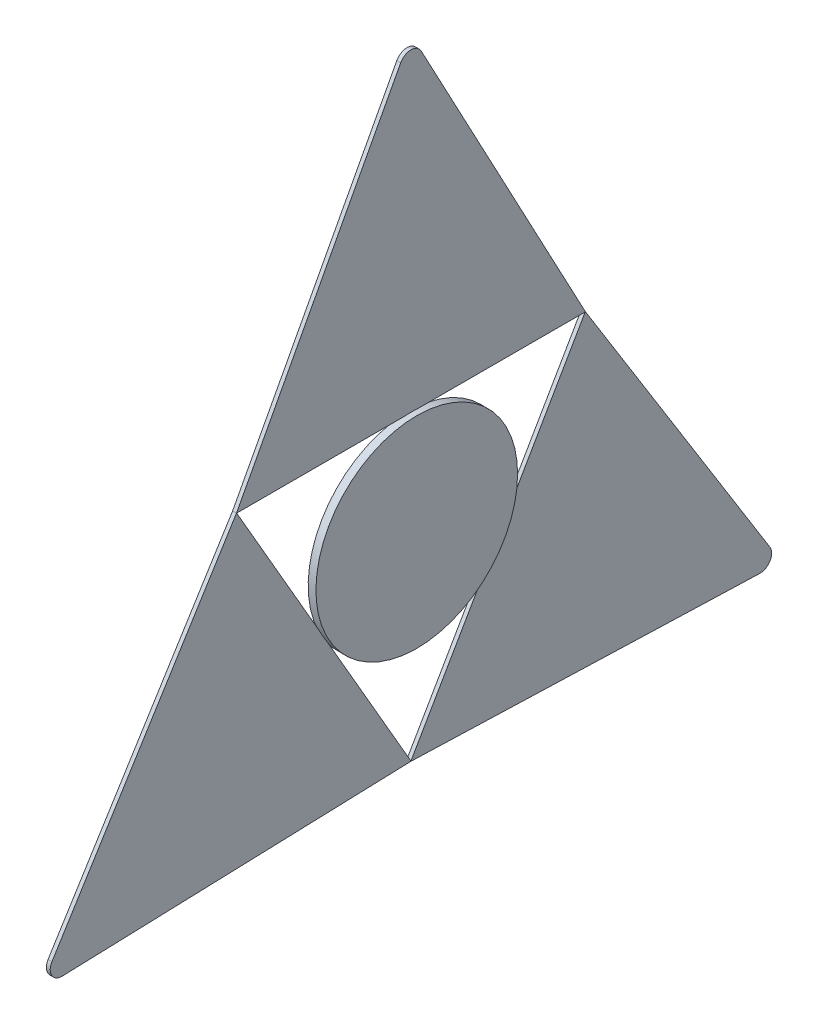
ISO-10303-21;
HEADER;
FILE_DESCRIPTION(('STEP AP214'),'2;1');
FILE_NAME('part.step','',(''),(''),'','','');
FILE_SCHEMA(('AUTOMOTIVE_DESIGN { 1 0 10303 214 1 1 1 1 }'));
ENDSEC;
DATA;
#1=APPLICATION_CONTEXT('core data for automotive mechanical design processes');
#2=APPLICATION_PROTOCOL_DEFINITION('international standard','automotive_design',2000,#1);
#3=PRODUCT_CONTEXT('',#1,'mechanical');
#4=PRODUCT('Part','Part','',(#3));
#5=PRODUCT_RELATED_PRODUCT_CATEGORY('part','',(#4));
#6=PRODUCT_DEFINITION_FORMATION('','',#4);
#7=PRODUCT_DEFINITION_CONTEXT('part definition',#1,'design');
#8=PRODUCT_DEFINITION('design','',#6,#7);
#9=PRODUCT_DEFINITION_SHAPE('','',#8);
#10=(LENGTH_UNIT() NAMED_UNIT(*) SI_UNIT(.MILLI.,.METRE.));
#11=(NAMED_UNIT(*) PLANE_ANGLE_UNIT() SI_UNIT($,.RADIAN.));
#12=(NAMED_UNIT(*) SI_UNIT($,.STERADIAN.) SOLID_ANGLE_UNIT());
#13=UNCERTAINTY_MEASURE_WITH_UNIT(LENGTH_MEASURE(1.E-05),#10,'distance_accuracy_value','');
#14=(GEOMETRIC_REPRESENTATION_CONTEXT(3) GLOBAL_UNCERTAINTY_ASSIGNED_CONTEXT((#13)) GLOBAL_UNIT_ASSIGNED_CONTEXT((#10,
#11,#12)) REPRESENTATION_CONTEXT('',''));
#15=CARTESIAN_POINT('',(0.,0.,0.));
#16=DIRECTION('',(0.,0.,1.));
#17=DIRECTION('',(1.,0.,0.));
#18=AXIS2_PLACEMENT_3D('',#15,#16,#17);
#19=CARTESIAN_POINT('',(0.,-51.9711431702998,0.));
#20=DIRECTION('',(1.,0.,0.));
#21=DIRECTION('',(0.,0.,-1.));
#22=AXIS2_PLACEMENT_3D('',#19,#20,#21);
#23=PLANE('',#22);
#24=DIRECTION('',(0.,-0.866025403784436,-0.500000000000004));
#25=VECTOR('',#24,1.);
#26=CARTESIAN_POINT('',(0.,-58.4567147554498,11.2333395016047));
#27=LINE('',#26,#25);
#28=CARTESIAN_POINT('',(0.,-57.7069923790412,11.6661919174416));
#29=VERTEX_POINT('',#28);
#30=CARTESIAN_POINT('',(0.,-59.2064371318584,10.8004870857677));
#31=VERTEX_POINT('',#30);
#32=EDGE_CURVE('E310',#29,#31,#27,.T.);
#33=ORIENTED_EDGE('',*,*,#32,.F.);
#34=CARTESIAN_POINT('',(0.,-51.9711431702998,0.));
#35=DIRECTION('',(1.,0.,0.));
#36=DIRECTION('',(0.,0.,-1.));
#37=AXIS2_PLACEMENT_3D('',#34,#35,#36);
#38=CIRCLE('',#37,13.);
#39=CARTESIAN_POINT('',(0.,-39.,0.86570483167403));
#40=VERTEX_POINT('',#39);
#41=EDGE_CURVE('E332',#40,#29,#38,.T.);
#42=ORIENTED_EDGE('',*,*,#41,.F.);
#43=DIRECTION('',(0.,0.,-1.));
#44=VECTOR('',#43,1.);
#45=CARTESIAN_POINT('',(0.,-39.,22.5));
#46=LINE('',#45,#44);
#47=CARTESIAN_POINT('',(0.,-39.,-0.86570483167404));
#48=VERTEX_POINT('',#47);
#49=EDGE_CURVE('E383',#40,#48,#46,.T.);
#50=ORIENTED_EDGE('',*,*,#49,.T.);
#51=CARTESIAN_POINT('',(0.,-57.7069923790409,-11.6661919174418));
#52=VERTEX_POINT('',#51);
#53=EDGE_CURVE('E326',#52,#48,#38,.T.);
#54=ORIENTED_EDGE('',*,*,#53,.F.);
#55=DIRECTION('',(0.,0.866025403784443,-0.499999999999992));
#56=VECTOR('',#55,1.);
#57=CARTESIAN_POINT('',(0.,-58.4567147554497,-11.2333395016047));
#58=LINE('',#57,#56);
#59=CARTESIAN_POINT('',(0.,-59.2064371318584,-10.8004870857677));
#60=VERTEX_POINT('',#59);
#61=EDGE_CURVE('E299',#60,#52,#58,.T.);
#62=ORIENTED_EDGE('',*,*,#61,.F.);
#63=EDGE_CURVE('E336',#31,#60,#38,.T.);
#64=ORIENTED_EDGE('',*,*,#63,.F.);
#65=EDGE_LOOP('',(#33,#42,#50,#54,#62,#64));
#66=FACE_BOUND('',#65,.T.);
#67=DIRECTION('',(0.,1.,0.));
#68=VECTOR('',#67,1.);
#69=CARTESIAN_POINT('',(0.,-46.9711431702998,4.99999999999999));
#70=LINE('',#69,#68);
#71=CARTESIAN_POINT('',(0.,-56.9711431702998,4.99999999999999));
#72=VERTEX_POINT('',#71);
#73=CARTESIAN_POINT('',(0.,-46.9711431702998,4.99999999999999));
#74=VERTEX_POINT('',#73);
#75=EDGE_CURVE('E213',#72,#74,#70,.T.);
#76=ORIENTED_EDGE('',*,*,#75,.F.);
#77=DIRECTION('',(0.,0.,1.));
#78=VECTOR('',#77,1.);
#79=CARTESIAN_POINT('',(0.,-56.9711431702998,-5.00000000000001));
#80=LINE('',#79,#78);
#81=CARTESIAN_POINT('',(0.,-56.9711431702998,-5.00000000000001));
#82=VERTEX_POINT('',#81);
#83=EDGE_CURVE('E210',#82,#72,#80,.T.);
#84=ORIENTED_EDGE('',*,*,#83,.F.);
#85=DIRECTION('',(0.,-1.,0.));
#86=VECTOR('',#85,1.);
#87=CARTESIAN_POINT('',(0.,-46.9711431702998,-5.00000000000001));
#88=LINE('',#87,#86);
#89=CARTESIAN_POINT('',(0.,-46.9711431702998,-5.00000000000001));
#90=VERTEX_POINT('',#89);
#91=EDGE_CURVE('E62',#90,#82,#88,.T.);
#92=ORIENTED_EDGE('',*,*,#91,.F.);
#93=DIRECTION('',(0.,0.,-1.));
#94=VECTOR('',#93,1.);
#95=CARTESIAN_POINT('',(0.,-46.9711431702998,-5.00000000000001));
#96=LINE('',#95,#94);
#97=EDGE_CURVE('E57',#74,#90,#96,.T.);
#98=ORIENTED_EDGE('',*,*,#97,.F.);
#99=EDGE_LOOP('',(#76,#84,#92,#98));
#100=FACE_BOUND('',#99,.T.);
#101=ADVANCED_FACE('F41',(#66,#100),#23,.F.);
#102=CARTESIAN_POINT('',(0.25,-39.,22.5));
#103=DIRECTION('',(0.,1.,0.));
#104=DIRECTION('',(0.,0.,1.));
#105=AXIS2_PLACEMENT_3D('',#102,#103,#104);
#106=PLANE('',#105);
#107=DIRECTION('',(1.,0.,0.));
#108=VECTOR('',#107,1.);
#109=CARTESIAN_POINT('',(0.25,-39.,22.4666790032095));
#110=LINE('',#109,#108);
#111=CARTESIAN_POINT('',(-0.25,-39.,22.4666790032095));
#112=VERTEX_POINT('',#111);
#113=CARTESIAN_POINT('',(0.25,-39.,22.4666790032095));
#114=VERTEX_POINT('',#113);
#115=EDGE_CURVE('E314',#112,#114,#110,.T.);
#116=ORIENTED_EDGE('',*,*,#115,.F.);
#117=DIRECTION('',(0.,0.,-1.));
#118=VECTOR('',#117,1.);
#119=CARTESIAN_POINT('',(-0.25,-39.,22.5));
#120=LINE('',#119,#118);
#121=CARTESIAN_POINT('',(-0.25,-39.,-22.4666790032091));
#122=VERTEX_POINT('',#121);
#123=EDGE_CURVE('E368',#112,#122,#120,.T.);
#124=ORIENTED_EDGE('',*,*,#123,.T.);
#125=DIRECTION('',(-1.,0.,0.));
#126=VECTOR('',#125,1.);
#127=CARTESIAN_POINT('',(0.25,-39.,-22.4666790032091));
#128=LINE('',#127,#126);
#129=CARTESIAN_POINT('',(0.25,-39.,-22.4666790032091));
#130=VERTEX_POINT('',#129);
#131=EDGE_CURVE('E306',#130,#122,#128,.T.);
#132=ORIENTED_EDGE('',*,*,#131,.F.);
#133=DIRECTION('',(0.,0.,-1.));
#134=VECTOR('',#133,1.);
#135=CARTESIAN_POINT('',(0.25,-39.,22.5));
#136=LINE('',#135,#134);
#137=CARTESIAN_POINT('',(0.25,-39.,-0.865704831674071));
#138=VERTEX_POINT('',#137);
#139=EDGE_CURVE('E353',#138,#130,#136,.T.);
#140=ORIENTED_EDGE('',*,*,#139,.F.);
#141=DIRECTION('',(-1.,0.,0.));
#142=VECTOR('',#141,1.);
#143=CARTESIAN_POINT('',(1.,-39.,-0.86570483167404));
#144=LINE('',#143,#142);
#145=EDGE_CURVE('E340',#48,#138,#144,.F.);
#146=ORIENTED_EDGE('',*,*,#145,.F.);
#147=ORIENTED_EDGE('',*,*,#49,.F.);
#148=DIRECTION('',(-1.,0.,0.));
#149=VECTOR('',#148,1.);
#150=CARTESIAN_POINT('',(1.,-39.,0.86570483167403));
#151=LINE('',#150,#149);
#152=CARTESIAN_POINT('',(0.25,-39.,0.865704831674061));
#153=VERTEX_POINT('',#152);
#154=EDGE_CURVE('E331',#153,#40,#151,.T.);
#155=ORIENTED_EDGE('',*,*,#154,.F.);
#156=EDGE_CURVE('E354',#114,#153,#136,.T.);
#157=ORIENTED_EDGE('',*,*,#156,.F.);
#158=EDGE_LOOP('',(#116,#124,#132,#140,#146,#147,#155,#157));
#159=FACE_BOUND('',#158,.T.);
#160=ADVANCED_FACE('F438',(#159),#106,.F.);
#161=CARTESIAN_POINT('',(0.25,0.705882352941176,1.32352941176471));
#162=DIRECTION('',(0.,-0.470588235294118,-0.882352941176471));
#163=DIRECTION('',(0.,0.882352941176471,-0.470588235294118));
#164=AXIS2_PLACEMENT_3D('',#161,#162,#163);
#165=PLANE('',#164);
#166=DIRECTION('',(-1.,0.,0.));
#167=VECTOR('',#166,1.);
#168=CARTESIAN_POINT('',(0.25,-38.9852912377247,22.4921553267865));
#169=LINE('',#168,#167);
#170=CARTESIAN_POINT('',(0.25,-38.9852912377247,22.4921553267865));
#171=VERTEX_POINT('',#170);
#172=CARTESIAN_POINT('',(-0.25,-38.9852912377247,22.4921553267865));
#173=VERTEX_POINT('',#172);
#174=EDGE_CURVE('E322',#171,#173,#169,.T.);
#175=ORIENTED_EDGE('',*,*,#174,.F.);
#176=DIRECTION('',(0.,-0.882352941176471,0.470588235294118));
#177=VECTOR('',#176,1.);
#178=CARTESIAN_POINT('',(0.25,0.705882352941176,1.32352941176471));
#179=LINE('',#178,#177);
#180=CARTESIAN_POINT('',(0.25,0.705882352941176,1.32352941176471));
#181=VERTEX_POINT('',#180);
#182=EDGE_CURVE('E357',#181,#171,#179,.T.);
#183=ORIENTED_EDGE('',*,*,#182,.F.);
#184=DIRECTION('',(-1.,0.,0.));
#185=VECTOR('',#184,1.);
#186=CARTESIAN_POINT('',(0.25,0.705882352941176,1.32352941176471));
#187=LINE('',#186,#185);
#188=CARTESIAN_POINT('',(-0.25,0.705882352941176,1.32352941176471));
#189=VERTEX_POINT('',#188);
#190=EDGE_CURVE('E373',#181,#189,#187,.T.);
#191=ORIENTED_EDGE('',*,*,#190,.T.);
#192=DIRECTION('',(0.,-0.882352941176471,0.470588235294118));
#193=VECTOR('',#192,1.);
#194=CARTESIAN_POINT('',(-0.25,0.705882352941176,1.32352941176471));
#195=LINE('',#194,#193);
#196=EDGE_CURVE('E350',#189,#173,#195,.T.);
#197=ORIENTED_EDGE('',*,*,#196,.T.);
#198=EDGE_LOOP('',(#175,#183,#191,#197));
#199=FACE_BOUND('',#198,.T.);
#200=ADVANCED_FACE('F442',(#199),#165,.F.);
#201=CARTESIAN_POINT('',(0.25,-39.,-22.5));
#202=DIRECTION('',(0.,-0.470588235294118,0.882352941176471));
#203=DIRECTION('',(0.,-0.882352941176471,-0.470588235294118));
#204=AXIS2_PLACEMENT_3D('',#201,#202,#203);
#205=PLANE('',#204);
#206=DIRECTION('',(1.,0.,0.));
#207=VECTOR('',#206,1.);
#208=CARTESIAN_POINT('',(0.25,-38.9852912377247,-22.4921553267865));
#209=LINE('',#208,#207);
#210=CARTESIAN_POINT('',(-0.25,-38.9852912377252,-22.4921553267868));
#211=VERTEX_POINT('',#210);
#212=CARTESIAN_POINT('',(0.25,-38.9852912377252,-22.4921553267868));
#213=VERTEX_POINT('',#212);
#214=EDGE_CURVE('E318',#211,#213,#209,.T.);
#215=ORIENTED_EDGE('',*,*,#214,.F.);
#216=DIRECTION('',(0.,0.882352941176471,0.470588235294118));
#217=VECTOR('',#216,1.);
#218=CARTESIAN_POINT('',(-0.25,-39.,-22.5));
#219=LINE('',#218,#217);
#220=CARTESIAN_POINT('',(-0.25,0.705882352941176,-1.32352941176471));
#221=VERTEX_POINT('',#220);
#222=EDGE_CURVE('E365',#211,#221,#219,.T.);
#223=ORIENTED_EDGE('',*,*,#222,.T.);
#224=DIRECTION('',(-1.,0.,0.));
#225=VECTOR('',#224,1.);
#226=CARTESIAN_POINT('',(0.25,0.705882352941176,-1.32352941176471));
#227=LINE('',#226,#225);
#228=CARTESIAN_POINT('',(0.25,0.705882352941176,-1.32352941176471));
#229=VERTEX_POINT('',#228);
#230=EDGE_CURVE('E361',#229,#221,#227,.T.);
#231=ORIENTED_EDGE('',*,*,#230,.F.);
#232=DIRECTION('',(0.,0.882352941176471,0.470588235294118));
#233=VECTOR('',#232,1.);
#234=CARTESIAN_POINT('',(0.25,-39.,-22.5));
#235=LINE('',#234,#233);
#236=EDGE_CURVE('E349',#213,#229,#235,.T.);
#237=ORIENTED_EDGE('',*,*,#236,.F.);
#238=EDGE_LOOP('',(#215,#223,#231,#237));
#239=FACE_BOUND('',#238,.T.);
#240=ADVANCED_FACE('F448',(#239),#205,.F.);
#241=CARTESIAN_POINT('',(1.,-51.9711431702998,0.));
#242=DIRECTION('',(-1.,0.,0.));
#243=DIRECTION('',(0.,0.,1.));
#244=AXIS2_PLACEMENT_3D('',#241,#242,#243);
#245=CYLINDRICAL_SURFACE('',#244,13.);
#246=CARTESIAN_POINT('',(1.,-51.9711431702998,0.));
#247=DIRECTION('',(1.,0.,0.));
#248=DIRECTION('',(0.,0.,-1.));
#249=AXIS2_PLACEMENT_3D('',#246,#247,#248);
#250=CIRCLE('',#249,13.);
#251=CARTESIAN_POINT('',(1.,-51.9711431702998,-13.));
#252=VERTEX_POINT('',#251);
#253=EDGE_CURVE('E327',#252,#252,#250,.T.);
#254=ORIENTED_EDGE('',*,*,#253,.F.);
#255=EDGE_LOOP('',(#254));
#256=FACE_BOUND('',#255,.T.);
#257=DIRECTION('',(-1.,0.,0.));
#258=VECTOR('',#257,1.);
#259=CARTESIAN_POINT('',(1.,-57.7069923790412,11.6661919174416));
#260=LINE('',#259,#258);
#261=CARTESIAN_POINT('',(0.25,-57.7069923790412,11.6661919174416));
#262=VERTEX_POINT('',#261);
#263=EDGE_CURVE('E11',#262,#29,#260,.T.);
#264=ORIENTED_EDGE('',*,*,#263,.F.);
#265=CARTESIAN_POINT('',(0.25,-51.9711431702998,0.));
#266=DIRECTION('',(-1.,0.,0.));
#267=DIRECTION('',(0.,0.,1.));
#268=AXIS2_PLACEMENT_3D('',#265,#266,#267);
#269=CIRCLE('',#268,13.);
#270=CARTESIAN_POINT('',(0.25,-59.2064371318584,10.8004870857677));
#271=VERTEX_POINT('',#270);
#272=EDGE_CURVE('E396',#271,#262,#269,.T.);
#273=ORIENTED_EDGE('',*,*,#272,.F.);
#274=DIRECTION('',(-1.,0.,0.));
#275=VECTOR('',#274,1.);
#276=CARTESIAN_POINT('',(1.,-59.2064371318584,10.8004870857677));
#277=LINE('',#276,#275);
#278=EDGE_CURVE('E50',#31,#271,#277,.F.);
#279=ORIENTED_EDGE('',*,*,#278,.F.);
#280=ORIENTED_EDGE('',*,*,#63,.T.);
#281=DIRECTION('',(-1.,0.,0.));
#282=VECTOR('',#281,1.);
#283=CARTESIAN_POINT('',(1.,-59.2064371318584,-10.8004870857677));
#284=LINE('',#283,#282);
#285=CARTESIAN_POINT('',(0.25,-59.2064371318585,-10.8004870857676));
#286=VERTEX_POINT('',#285);
#287=EDGE_CURVE('E395',#286,#60,#284,.T.);
#288=ORIENTED_EDGE('',*,*,#287,.F.);
#289=CARTESIAN_POINT('',(0.25,-57.7069923790409,-11.6661919174418));
#290=VERTEX_POINT('',#289);
#291=EDGE_CURVE('E391',#290,#286,#269,.T.);
#292=ORIENTED_EDGE('',*,*,#291,.F.);
#293=DIRECTION('',(-1.,0.,0.));
#294=VECTOR('',#293,1.);
#295=CARTESIAN_POINT('',(1.,-57.7069923790409,-11.6661919174418));
#296=LINE('',#295,#294);
#297=EDGE_CURVE('E387',#52,#290,#296,.F.);
#298=ORIENTED_EDGE('',*,*,#297,.F.);
#299=ORIENTED_EDGE('',*,*,#53,.T.);
#300=ORIENTED_EDGE('',*,*,#145,.T.);
#301=CARTESIAN_POINT('',(0.25,-51.9711431702998,0.));
#302=DIRECTION('',(-1.,0.,0.));
#303=DIRECTION('',(0.,0.,1.));
#304=AXIS2_PLACEMENT_3D('',#301,#302,#303);
#305=CIRCLE('',#304,13.);
#306=EDGE_CURVE('E376',#138,#153,#305,.F.);
#307=ORIENTED_EDGE('',*,*,#306,.T.);
#308=ORIENTED_EDGE('',*,*,#154,.T.);
#309=ORIENTED_EDGE('',*,*,#41,.T.);
#310=EDGE_LOOP('',(#264,#273,#279,#280,#288,#292,#298,#299,#300,#307,#308,#309));
#311=FACE_BOUND('',#310,.T.);
#312=ADVANCED_FACE('F423',(#256,#311),#245,.T.);
#313=CARTESIAN_POINT('',(0.25,0.,0.));
#314=DIRECTION('',(-1.,0.,0.));
#315=DIRECTION('',(0.,0.,1.));
#316=AXIS2_PLACEMENT_3D('',#313,#314,#315);
#317=CYLINDRICAL_SURFACE('',#316,1.5);
#318=CARTESIAN_POINT('',(-0.25,0.,0.));
#319=DIRECTION('',(-1.,0.,0.));
#320=DIRECTION('',(0.,0.,1.));
#321=AXIS2_PLACEMENT_3D('',#318,#319,#320);
#322=CIRCLE('',#321,1.5);
#323=EDGE_CURVE('E344',#189,#221,#322,.T.);
#324=ORIENTED_EDGE('',*,*,#323,.F.);
#325=ORIENTED_EDGE('',*,*,#190,.F.);
#326=CARTESIAN_POINT('',(0.25,0.,0.));
#327=DIRECTION('',(-1.,0.,0.));
#328=DIRECTION('',(0.,0.,1.));
#329=AXIS2_PLACEMENT_3D('',#326,#327,#328);
#330=CIRCLE('',#329,1.5);
#331=EDGE_CURVE('E345',#181,#229,#330,.T.);
#332=ORIENTED_EDGE('',*,*,#331,.T.);
#333=ORIENTED_EDGE('',*,*,#230,.T.);
#334=EDGE_LOOP('',(#324,#325,#332,#333));
#335=FACE_BOUND('',#334,.T.);
#336=ADVANCED_FACE('F43',(#335),#317,.T.);
#337=CARTESIAN_POINT('',(0.25,0.,0.));
#338=DIRECTION('',(-1.,0.,0.));
#339=DIRECTION('',(0.,0.,1.));
#340=AXIS2_PLACEMENT_3D('',#337,#338,#339);
#341=PLANE('',#340);
#342=ORIENTED_EDGE('',*,*,#139,.T.);
#343=DIRECTION('',(0.,-0.866025403784443,0.499999999999992));
#344=VECTOR('',#343,1.);
#345=CARTESIAN_POINT('',(0.25,-38.9711431702997,-22.4833395016046));
#346=LINE('',#345,#344);
#347=EDGE_CURVE('E237',#130,#290,#346,.T.);
#348=ORIENTED_EDGE('',*,*,#347,.T.);
#349=ORIENTED_EDGE('',*,*,#291,.T.);
#350=CARTESIAN_POINT('',(0.25,-77.9134295108996,-1.74808965588448E-13));
#351=VERTEX_POINT('',#350);
#352=EDGE_CURVE('E234',#286,#351,#346,.T.);
#353=ORIENTED_EDGE('',*,*,#352,.T.);
#354=DIRECTION('',(0.,0.866025403784436,0.500000000000004));
#355=VECTOR('',#354,1.);
#356=CARTESIAN_POINT('',(0.25,-77.9422863405996,-0.0166604983954377));
#357=LINE('',#356,#355);
#358=EDGE_CURVE('E275',#351,#271,#357,.T.);
#359=ORIENTED_EDGE('',*,*,#358,.T.);
#360=ORIENTED_EDGE('',*,*,#272,.T.);
#361=EDGE_CURVE('E274',#262,#114,#357,.T.);
#362=ORIENTED_EDGE('',*,*,#361,.T.);
#363=ORIENTED_EDGE('',*,*,#156,.T.);
#364=ORIENTED_EDGE('',*,*,#306,.F.);
#365=EDGE_LOOP('',(#342,#348,#349,#353,#359,#360,#362,#363,#364));
#366=FACE_BOUND('',#365,.T.);
#367=ORIENTED_EDGE('',*,*,#182,.T.);
#368=DIRECTION('',(0.,-0.848717837075033,0.528845944515677));
#369=VECTOR('',#368,1.);
#370=CARTESIAN_POINT('',(0.25,-38.9711431703,22.4833395016047));
#371=LINE('',#370,#369);
#372=CARTESIAN_POINT('',(0.25,-77.1634458386765,46.2814070048102));
#373=VERTEX_POINT('',#372);
#374=EDGE_CURVE('E270',#171,#373,#371,.T.);
#375=ORIENTED_EDGE('',*,*,#374,.T.);
#376=CARTESIAN_POINT('',(0.25,-77.95671475545,45.0083302491977));
#377=DIRECTION('',(-1.,0.,0.));
#378=DIRECTION('',(0.,-0.866025403784436,-0.500000000000004));
#379=AXIS2_PLACEMENT_3D('',#376,#377,#378);
#380=CIRCLE('',#379,1.5);
#381=CARTESIAN_POINT('',(0.25,-79.4558660251647,44.9578775930455));
#382=VERTEX_POINT('',#381);
#383=EDGE_CURVE('E266',#382,#373,#380,.T.);
#384=ORIENTED_EDGE('',*,*,#383,.F.);
#385=DIRECTION('',(0.,0.0336351041014454,-0.999434179809799));
#386=VECTOR('',#385,1.);
#387=CARTESIAN_POINT('',(0.25,-79.4558660251647,44.9578775930455));
#388=LINE('',#387,#386);
#389=CARTESIAN_POINT('',(0.25,-77.94284703545,-4.47558656802016E-13));
#390=VERTEX_POINT('',#389);
#391=EDGE_CURVE('E279',#382,#390,#388,.T.);
#392=ORIENTED_EDGE('',*,*,#391,.T.);
#393=DIRECTION('',(0.,-0.0336351041014314,-0.999434179809799));
#394=VECTOR('',#393,1.);
#395=CARTESIAN_POINT('',(0.25,-77.9422863405996,0.0166604983950699));
#396=LINE('',#395,#394);
#397=CARTESIAN_POINT('',(0.25,-79.455866025164,-44.9578775930459));
#398=VERTEX_POINT('',#397);
#399=EDGE_CURVE('E230',#390,#398,#396,.T.);
#400=ORIENTED_EDGE('',*,*,#399,.T.);
#401=CARTESIAN_POINT('',(0.25,-77.9567147554493,-45.008330249198));
#402=DIRECTION('',(-1.,0.,0.));
#403=DIRECTION('',(0.,0.866025403784443,-0.499999999999992));
#404=AXIS2_PLACEMENT_3D('',#401,#402,#403);
#405=CIRCLE('',#404,1.5);
#406=CARTESIAN_POINT('',(0.25,-77.1634458386758,-46.2814070048106));
#407=VERTEX_POINT('',#406);
#408=EDGE_CURVE('E226',#407,#398,#405,.T.);
#409=ORIENTED_EDGE('',*,*,#408,.F.);
#410=DIRECTION('',(0.,0.848717837075025,0.528845944515689));
#411=VECTOR('',#410,1.);
#412=CARTESIAN_POINT('',(0.25,-77.1634458386758,-46.2814070048106));
#413=LINE('',#412,#411);
#414=EDGE_CURVE('E238',#407,#213,#413,.T.);
#415=ORIENTED_EDGE('',*,*,#414,.T.);
#416=ORIENTED_EDGE('',*,*,#236,.T.);
#417=ORIENTED_EDGE('',*,*,#331,.F.);
#418=EDGE_LOOP('',(#367,#375,#384,#392,#400,#409,#415,#416,#417));
#419=FACE_BOUND('',#418,.T.);
#420=ADVANCED_FACE('F409',(#366,#419),#341,.F.);
#421=CARTESIAN_POINT('',(-0.25,0.,0.));
#422=DIRECTION('',(-1.,0.,0.));
#423=DIRECTION('',(0.,0.,1.));
#424=AXIS2_PLACEMENT_3D('',#421,#422,#423);
#425=PLANE('',#424);
#426=ORIENTED_EDGE('',*,*,#123,.F.);
#427=DIRECTION('',(0.,0.866025403784436,0.500000000000004));
#428=VECTOR('',#427,1.);
#429=CARTESIAN_POINT('',(-0.25,-77.9422863405996,-0.0166604983954377));
#430=LINE('',#429,#428);
#431=CARTESIAN_POINT('',(-0.25,-77.9134295108996,-1.83880688453542E-13));
#432=VERTEX_POINT('',#431);
#433=EDGE_CURVE('E290',#432,#112,#430,.T.);
#434=ORIENTED_EDGE('',*,*,#433,.F.);
#435=DIRECTION('',(0.,-0.866025403784443,0.499999999999992));
#436=VECTOR('',#435,1.);
#437=CARTESIAN_POINT('',(-0.25,-38.9711431702997,-22.4833395016046));
#438=LINE('',#437,#436);
#439=EDGE_CURVE('E245',#122,#432,#438,.T.);
#440=ORIENTED_EDGE('',*,*,#439,.F.);
#441=EDGE_LOOP('',(#426,#434,#440));
#442=FACE_BOUND('',#441,.T.);
#443=DIRECTION('',(0.,-0.848717837075033,0.528845944515677));
#444=VECTOR('',#443,1.);
#445=CARTESIAN_POINT('',(-0.25,-38.9711431703,22.4833395016047));
#446=LINE('',#445,#444);
#447=CARTESIAN_POINT('',(-0.25,-77.1634458386765,46.2814070048102));
#448=VERTEX_POINT('',#447);
#449=EDGE_CURVE('E287',#173,#448,#446,.T.);
#450=ORIENTED_EDGE('',*,*,#449,.F.);
#451=ORIENTED_EDGE('',*,*,#196,.F.);
#452=ORIENTED_EDGE('',*,*,#323,.T.);
#453=ORIENTED_EDGE('',*,*,#222,.F.);
#454=DIRECTION('',(0.,0.848717837075025,0.528845944515689));
#455=VECTOR('',#454,1.);
#456=CARTESIAN_POINT('',(-0.25,-77.1634458386758,-46.2814070048106));
#457=LINE('',#456,#455);
#458=CARTESIAN_POINT('',(-0.25,-77.1634458386758,-46.2814070048106));
#459=VERTEX_POINT('',#458);
#460=EDGE_CURVE('E231',#459,#211,#457,.T.);
#461=ORIENTED_EDGE('',*,*,#460,.F.);
#462=CARTESIAN_POINT('',(-0.25,-77.9567147554493,-45.008330249198));
#463=DIRECTION('',(-1.,0.,0.));
#464=DIRECTION('',(0.,0.866025403784443,-0.499999999999992));
#465=AXIS2_PLACEMENT_3D('',#462,#463,#464);
#466=CIRCLE('',#465,1.5);
#467=CARTESIAN_POINT('',(-0.25,-79.455866025164,-44.9578775930459));
#468=VERTEX_POINT('',#467);
#469=EDGE_CURVE('E215',#459,#468,#466,.T.);
#470=ORIENTED_EDGE('',*,*,#469,.T.);
#471=DIRECTION('',(0.,-0.0336351041014314,-0.999434179809799));
#472=VECTOR('',#471,1.);
#473=CARTESIAN_POINT('',(-0.25,-77.9422863405996,0.0166604983950699));
#474=LINE('',#473,#472);
#475=CARTESIAN_POINT('',(-0.25,-77.94284703545,-4.47558656802016E-13));
#476=VERTEX_POINT('',#475);
#477=EDGE_CURVE('E220',#476,#468,#474,.T.);
#478=ORIENTED_EDGE('',*,*,#477,.F.);
#479=DIRECTION('',(0.,0.0336351041014454,-0.999434179809799));
#480=VECTOR('',#479,1.);
#481=CARTESIAN_POINT('',(-0.25,-79.4558660251647,44.9578775930455));
#482=LINE('',#481,#480);
#483=CARTESIAN_POINT('',(-0.25,-79.4558660251647,44.9578775930455));
#484=VERTEX_POINT('',#483);
#485=EDGE_CURVE('E271',#484,#476,#482,.T.);
#486=ORIENTED_EDGE('',*,*,#485,.F.);
#487=CARTESIAN_POINT('',(-0.25,-77.95671475545,45.0083302491977));
#488=DIRECTION('',(-1.,0.,0.));
#489=DIRECTION('',(0.,-0.866025403784436,-0.500000000000004));
#490=AXIS2_PLACEMENT_3D('',#487,#488,#489);
#491=CIRCLE('',#490,1.5);
#492=EDGE_CURVE('E265',#484,#448,#491,.T.);
#493=ORIENTED_EDGE('',*,*,#492,.T.);
#494=EDGE_LOOP('',(#450,#451,#452,#453,#461,#470,#478,#486,#493));
#495=FACE_BOUND('',#494,.T.);
#496=ADVANCED_FACE('F435',(#442,#495),#425,.T.);
#497=CARTESIAN_POINT('',(1.,-51.9711431702998,0.));
#498=DIRECTION('',(1.,0.,0.));
#499=DIRECTION('',(0.,0.,-1.));
#500=AXIS2_PLACEMENT_3D('',#497,#498,#499);
#501=PLANE('',#500);
#502=ORIENTED_EDGE('',*,*,#253,.T.);
#503=EDGE_LOOP('',(#502));
#504=FACE_BOUND('',#503,.T.);
#505=ADVANCED_FACE('F504',(#504),#501,.T.);
#506=CARTESIAN_POINT('',(0.25,-38.9711431703,22.4833395016047));
#507=DIRECTION('',(0.,-0.528845944515677,-0.848717837075032));
#508=DIRECTION('',(0.,0.848717837075032,-0.528845944515677));
#509=AXIS2_PLACEMENT_3D('',#506,#507,#508);
#510=PLANE('',#509);
#511=ORIENTED_EDGE('',*,*,#374,.F.);
#512=ORIENTED_EDGE('',*,*,#174,.T.);
#513=ORIENTED_EDGE('',*,*,#449,.T.);
#514=DIRECTION('',(-1.,0.,0.));
#515=VECTOR('',#514,1.);
#516=CARTESIAN_POINT('',(0.25,-77.1634458386765,46.2814070048102));
#517=LINE('',#516,#515);
#518=EDGE_CURVE('E283',#373,#448,#517,.T.);
#519=ORIENTED_EDGE('',*,*,#518,.F.);
#520=EDGE_LOOP('',(#511,#512,#513,#519));
#521=FACE_BOUND('',#520,.T.);
#522=ADVANCED_FACE('F491',(#521),#510,.F.);
#523=CARTESIAN_POINT('',(0.25,-77.1634458386758,-46.2814070048106));
#524=DIRECTION('',(0.,-0.528845944515689,0.848717837075025));
#525=DIRECTION('',(0.,-0.848717837075025,-0.528845944515689));
#526=AXIS2_PLACEMENT_3D('',#523,#524,#525);
#527=PLANE('',#526);
#528=ORIENTED_EDGE('',*,*,#460,.T.);
#529=ORIENTED_EDGE('',*,*,#214,.T.);
#530=ORIENTED_EDGE('',*,*,#414,.F.);
#531=DIRECTION('',(-1.,0.,0.));
#532=VECTOR('',#531,1.);
#533=CARTESIAN_POINT('',(0.25,-77.1634458386758,-46.2814070048106));
#534=LINE('',#533,#532);
#535=EDGE_CURVE('E251',#407,#459,#534,.T.);
#536=ORIENTED_EDGE('',*,*,#535,.T.);
#537=EDGE_LOOP('',(#528,#529,#530,#536));
#538=FACE_BOUND('',#537,.T.);
#539=ADVANCED_FACE('F471',(#538),#527,.F.);
#540=CARTESIAN_POINT('',(0.25,-77.9422863405996,-0.0166604983954377));
#541=DIRECTION('',(0.,-0.500000000000004,0.866025403784436));
#542=DIRECTION('',(0.,-0.866025403784436,-0.500000000000004));
#543=AXIS2_PLACEMENT_3D('',#540,#541,#542);
#544=PLANE('',#543);
#545=ORIENTED_EDGE('',*,*,#433,.T.);
#546=ORIENTED_EDGE('',*,*,#115,.T.);
#547=ORIENTED_EDGE('',*,*,#361,.F.);
#548=ORIENTED_EDGE('',*,*,#263,.T.);
#549=ORIENTED_EDGE('',*,*,#32,.T.);
#550=ORIENTED_EDGE('',*,*,#278,.T.);
#551=ORIENTED_EDGE('',*,*,#358,.F.);
#552=DIRECTION('',(1.,0.,0.));
#553=VECTOR('',#552,1.);
#554=CARTESIAN_POINT('',(0.25,-77.9134295108996,-1.79110198894605E-13));
#555=LINE('',#554,#553);
#556=EDGE_CURVE('E261',#432,#351,#555,.T.);
#557=ORIENTED_EDGE('',*,*,#556,.F.);
#558=EDGE_LOOP('',(#545,#546,#547,#548,#549,#550,#551,#557));
#559=FACE_BOUND('',#558,.T.);
#560=ADVANCED_FACE('F412',(#559),#544,.F.);
#561=CARTESIAN_POINT('',(0.25,-38.9711431702997,-22.4833395016046));
#562=DIRECTION('',(0.,-0.499999999999992,-0.866025403784443));
#563=DIRECTION('',(0.,0.866025403784443,-0.499999999999992));
#564=AXIS2_PLACEMENT_3D('',#561,#562,#563);
#565=PLANE('',#564);
#566=ORIENTED_EDGE('',*,*,#347,.F.);
#567=ORIENTED_EDGE('',*,*,#131,.T.);
#568=ORIENTED_EDGE('',*,*,#439,.T.);
#569=ORIENTED_EDGE('',*,*,#556,.T.);
#570=ORIENTED_EDGE('',*,*,#352,.F.);
#571=ORIENTED_EDGE('',*,*,#287,.T.);
#572=ORIENTED_EDGE('',*,*,#61,.T.);
#573=ORIENTED_EDGE('',*,*,#297,.T.);
#574=EDGE_LOOP('',(#566,#567,#568,#569,#570,#571,#572,#573));
#575=FACE_BOUND('',#574,.T.);
#576=ADVANCED_FACE('F420',(#575),#565,.F.);
#577=CARTESIAN_POINT('',(0.25,-79.4558660251647,44.9578775930455));
#578=DIRECTION('',(0.,0.999434179809799,0.0336351041014454));
#579=DIRECTION('',(0.,-0.0336351041014454,0.999434179809799));
#580=AXIS2_PLACEMENT_3D('',#577,#578,#579);
#581=PLANE('',#580);
#582=DIRECTION('',(-1.,0.,0.));
#583=VECTOR('',#582,1.);
#584=CARTESIAN_POINT('',(0.25,-77.94284703545,-4.37150315946155E-13));
#585=LINE('',#584,#583);
#586=EDGE_CURVE('E254',#390,#476,#585,.T.);
#587=ORIENTED_EDGE('',*,*,#586,.F.);
#588=ORIENTED_EDGE('',*,*,#391,.F.);
#589=DIRECTION('',(-1.,0.,0.));
#590=VECTOR('',#589,1.);
#591=CARTESIAN_POINT('',(0.25,-79.4558660251647,44.9578775930455));
#592=LINE('',#591,#590);
#593=EDGE_CURVE('E296',#382,#484,#592,.T.);
#594=ORIENTED_EDGE('',*,*,#593,.T.);
#595=ORIENTED_EDGE('',*,*,#485,.T.);
#596=EDGE_LOOP('',(#587,#588,#594,#595));
#597=FACE_BOUND('',#596,.T.);
#598=ADVANCED_FACE('F484',(#597),#581,.F.);
#599=CARTESIAN_POINT('',(0.25,-77.95671475545,45.0083302491977));
#600=DIRECTION('',(-1.,0.,0.));
#601=DIRECTION('',(0.,0.,1.));
#602=AXIS2_PLACEMENT_3D('',#599,#600,#601);
#603=CYLINDRICAL_SURFACE('',#602,1.5);
#604=ORIENTED_EDGE('',*,*,#492,.F.);
#605=ORIENTED_EDGE('',*,*,#593,.F.);
#606=ORIENTED_EDGE('',*,*,#383,.T.);
#607=ORIENTED_EDGE('',*,*,#518,.T.);
#608=EDGE_LOOP('',(#604,#605,#606,#607));
#609=FACE_BOUND('',#608,.T.);
#610=ADVANCED_FACE('F489',(#609),#603,.T.);
#611=CARTESIAN_POINT('',(0.25,-77.9422863405996,0.0166604983950699));
#612=DIRECTION('',(0.,0.999434179809799,-0.0336351041014314));
#613=DIRECTION('',(0.,0.0336351041014314,0.999434179809799));
#614=AXIS2_PLACEMENT_3D('',#611,#612,#613);
#615=PLANE('',#614);
#616=ORIENTED_EDGE('',*,*,#399,.F.);
#617=ORIENTED_EDGE('',*,*,#586,.T.);
#618=ORIENTED_EDGE('',*,*,#477,.T.);
#619=DIRECTION('',(-1.,0.,0.));
#620=VECTOR('',#619,1.);
#621=CARTESIAN_POINT('',(0.25,-79.455866025164,-44.9578775930459));
#622=LINE('',#621,#620);
#623=EDGE_CURVE('E241',#398,#468,#622,.T.);
#624=ORIENTED_EDGE('',*,*,#623,.F.);
#625=EDGE_LOOP('',(#616,#617,#618,#624));
#626=FACE_BOUND('',#625,.T.);
#627=ADVANCED_FACE('F481',(#626),#615,.F.);
#628=CARTESIAN_POINT('',(0.25,-77.9567147554493,-45.008330249198));
#629=DIRECTION('',(-1.,0.,0.));
#630=DIRECTION('',(0.,0.,1.));
#631=AXIS2_PLACEMENT_3D('',#628,#629,#630);
#632=CYLINDRICAL_SURFACE('',#631,1.5);
#633=ORIENTED_EDGE('',*,*,#469,.F.);
#634=ORIENTED_EDGE('',*,*,#535,.F.);
#635=ORIENTED_EDGE('',*,*,#408,.T.);
#636=ORIENTED_EDGE('',*,*,#623,.T.);
#637=EDGE_LOOP('',(#633,#634,#635,#636));
#638=FACE_BOUND('',#637,.T.);
#639=ADVANCED_FACE('F474',(#638),#632,.T.);
#640=CARTESIAN_POINT('',(-2.,-46.9711431702998,4.99999999999999));
#641=DIRECTION('',(0.,0.,-1.));
#642=DIRECTION('',(0.,1.,0.));
#643=AXIS2_PLACEMENT_3D('',#640,#641,#642);
#644=PLANE('',#643);
#645=ORIENTED_EDGE('',*,*,#75,.T.);
#646=DIRECTION('',(1.,0.,0.));
#647=VECTOR('',#646,1.);
#648=CARTESIAN_POINT('',(-2.,-46.9711431702998,4.99999999999999));
#649=LINE('',#648,#647);
#650=CARTESIAN_POINT('',(-2.,-46.9711431702998,4.99999999999999));
#651=VERTEX_POINT('',#650);
#652=EDGE_CURVE('E192',#651,#74,#649,.T.);
#653=ORIENTED_EDGE('',*,*,#652,.F.);
#654=DIRECTION('',(0.,1.,0.));
#655=VECTOR('',#654,1.);
#656=CARTESIAN_POINT('',(-2.,-46.9711431702998,4.99999999999999));
#657=LINE('',#656,#655);
#658=CARTESIAN_POINT('',(-2.,-56.9711431702998,4.99999999999999));
#659=VERTEX_POINT('',#658);
#660=EDGE_CURVE('E200',#659,#651,#657,.T.);
#661=ORIENTED_EDGE('',*,*,#660,.F.);
#662=DIRECTION('',(1.,0.,0.));
#663=VECTOR('',#662,1.);
#664=CARTESIAN_POINT('',(-2.,-56.9711431702998,4.99999999999999));
#665=LINE('',#664,#663);
#666=EDGE_CURVE('E690',#659,#72,#665,.T.);
#667=ORIENTED_EDGE('',*,*,#666,.T.);
#668=EDGE_LOOP('',(#645,#653,#661,#667));
#669=FACE_BOUND('',#668,.T.);
#670=ADVANCED_FACE('F212',(#669),#644,.F.);
#671=CARTESIAN_POINT('',(-2.,-46.9711431702998,-5.00000000000001));
#672=DIRECTION('',(0.,-1.,0.));
#673=DIRECTION('',(0.,0.,-1.));
#674=AXIS2_PLACEMENT_3D('',#671,#672,#673);
#675=PLANE('',#674);
#676=ORIENTED_EDGE('',*,*,#97,.T.);
#677=DIRECTION('',(1.,0.,0.));
#678=VECTOR('',#677,1.);
#679=CARTESIAN_POINT('',(-2.,-46.9711431702998,-5.00000000000001));
#680=LINE('',#679,#678);
#681=CARTESIAN_POINT('',(-2.,-46.9711431702998,-5.00000000000001));
#682=VERTEX_POINT('',#681);
#683=EDGE_CURVE('E195',#682,#90,#680,.T.);
#684=ORIENTED_EDGE('',*,*,#683,.F.);
#685=DIRECTION('',(0.,0.,-1.));
#686=VECTOR('',#685,1.);
#687=CARTESIAN_POINT('',(-2.,-46.9711431702998,-5.00000000000001));
#688=LINE('',#687,#686);
#689=EDGE_CURVE('E188',#651,#682,#688,.T.);
#690=ORIENTED_EDGE('',*,*,#689,.F.);
#691=ORIENTED_EDGE('',*,*,#652,.T.);
#692=EDGE_LOOP('',(#676,#684,#690,#691));
#693=FACE_BOUND('',#692,.T.);
#694=ADVANCED_FACE('F190',(#693),#675,.F.);
#695=CARTESIAN_POINT('',(-2.,-46.9711431702998,-5.00000000000001));
#696=DIRECTION('',(0.,0.,1.));
#697=DIRECTION('',(0.,-1.,0.));
#698=AXIS2_PLACEMENT_3D('',#695,#696,#697);
#699=PLANE('',#698);
#700=ORIENTED_EDGE('',*,*,#91,.T.);
#701=DIRECTION('',(1.,0.,0.));
#702=VECTOR('',#701,1.);
#703=CARTESIAN_POINT('',(-2.,-56.9711431702998,-5.00000000000001));
#704=LINE('',#703,#702);
#705=CARTESIAN_POINT('',(-2.,-56.9711431702998,-5.00000000000001));
#706=VERTEX_POINT('',#705);
#707=EDGE_CURVE('E222',#706,#82,#704,.T.);
#708=ORIENTED_EDGE('',*,*,#707,.F.);
#709=DIRECTION('',(0.,-1.,0.));
#710=VECTOR('',#709,1.);
#711=CARTESIAN_POINT('',(-2.,-46.9711431702998,-5.00000000000001));
#712=LINE('',#711,#710);
#713=EDGE_CURVE('E199',#682,#706,#712,.T.);
#714=ORIENTED_EDGE('',*,*,#713,.F.);
#715=ORIENTED_EDGE('',*,*,#683,.T.);
#716=EDGE_LOOP('',(#700,#708,#714,#715));
#717=FACE_BOUND('',#716,.T.);
#718=ADVANCED_FACE('F529',(#717),#699,.F.);
#719=CARTESIAN_POINT('',(-2.,-56.9711431702998,-5.00000000000001));
#720=DIRECTION('',(0.,1.,0.));
#721=DIRECTION('',(0.,0.,1.));
#722=AXIS2_PLACEMENT_3D('',#719,#720,#721);
#723=PLANE('',#722);
#724=ORIENTED_EDGE('',*,*,#83,.T.);
#725=ORIENTED_EDGE('',*,*,#666,.F.);
#726=DIRECTION('',(0.,0.,1.));
#727=VECTOR('',#726,1.);
#728=CARTESIAN_POINT('',(-2.,-56.9711431702998,-5.00000000000001));
#729=LINE('',#728,#727);
#730=EDGE_CURVE('E205',#706,#659,#729,.T.);
#731=ORIENTED_EDGE('',*,*,#730,.F.);
#732=ORIENTED_EDGE('',*,*,#707,.T.);
#733=EDGE_LOOP('',(#724,#725,#731,#732));
#734=FACE_BOUND('',#733,.T.);
#735=ADVANCED_FACE('F532',(#734),#723,.F.);
#736=CARTESIAN_POINT('',(-2.,0.,0.));
#737=DIRECTION('',(-1.,0.,0.));
#738=DIRECTION('',(0.,0.,1.));
#739=AXIS2_PLACEMENT_3D('',#736,#737,#738);
#740=PLANE('',#739);
#741=ORIENTED_EDGE('',*,*,#660,.T.);
#742=ORIENTED_EDGE('',*,*,#689,.T.);
#743=ORIENTED_EDGE('',*,*,#713,.T.);
#744=ORIENTED_EDGE('',*,*,#730,.T.);
#745=EDGE_LOOP('',(#741,#742,#743,#744));
#746=FACE_BOUND('',#745,.T.);
#747=ADVANCED_FACE('F203',(#746),#740,.T.);
#748=CLOSED_SHELL('',(#101,#160,#200,#240,#312,#336,#420,#496,#505,#522,#539,#560,#576,#598,
#610,#627,#639,#670,#694,#718,#735,#747));
#749=MANIFOLD_SOLID_BREP('B2',#748);
#750=ADVANCED_BREP_SHAPE_REPRESENTATION('',(#18,#749),#14);
#751=SHAPE_DEFINITION_REPRESENTATION(#9,#750);
ENDSEC;
END-ISO-10303-21;
